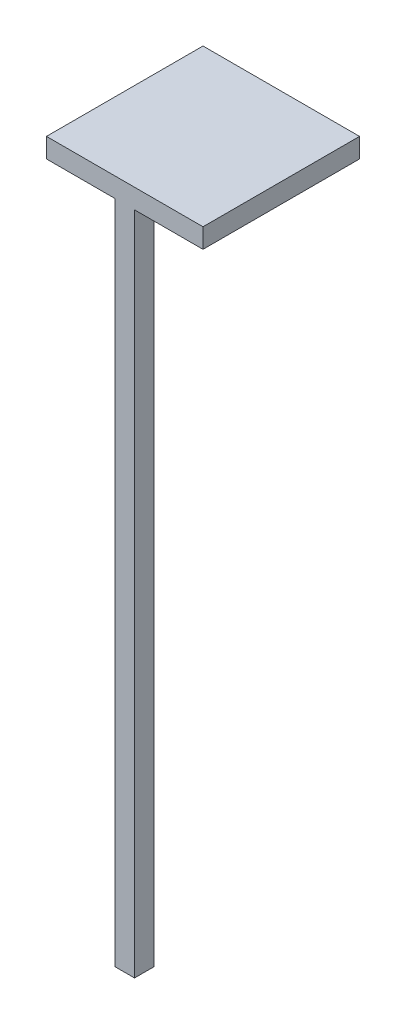
ISO-10303-21;
HEADER;
FILE_DESCRIPTION(('STEP AP214'),'2;1');
FILE_NAME('part.step','',(''),(''),'','','');
FILE_SCHEMA(('AUTOMOTIVE_DESIGN { 1 0 10303 214 1 1 1 1 }'));
ENDSEC;
DATA;
#1=APPLICATION_CONTEXT('core data for automotive mechanical design processes');
#2=APPLICATION_PROTOCOL_DEFINITION('international standard','automotive_design',2000,#1);
#3=PRODUCT_CONTEXT('',#1,'mechanical');
#4=PRODUCT('Part','Part','',(#3));
#5=PRODUCT_RELATED_PRODUCT_CATEGORY('part','',(#4));
#6=PRODUCT_DEFINITION_FORMATION('','',#4);
#7=PRODUCT_DEFINITION_CONTEXT('part definition',#1,'design');
#8=PRODUCT_DEFINITION('design','',#6,#7);
#9=PRODUCT_DEFINITION_SHAPE('','',#8);
#10=(LENGTH_UNIT() NAMED_UNIT(*) SI_UNIT(.MILLI.,.METRE.));
#11=(NAMED_UNIT(*) PLANE_ANGLE_UNIT() SI_UNIT($,.RADIAN.));
#12=(NAMED_UNIT(*) SI_UNIT($,.STERADIAN.) SOLID_ANGLE_UNIT());
#13=UNCERTAINTY_MEASURE_WITH_UNIT(LENGTH_MEASURE(1.E-05),#10,'distance_accuracy_value','');
#14=(GEOMETRIC_REPRESENTATION_CONTEXT(3) GLOBAL_UNCERTAINTY_ASSIGNED_CONTEXT((#13)) GLOBAL_UNIT_ASSIGNED_CONTEXT((#10,
#11,#12)) REPRESENTATION_CONTEXT('',''));
#15=CARTESIAN_POINT('',(0.,0.,0.));
#16=DIRECTION('',(0.,0.,1.));
#17=DIRECTION('',(1.,0.,0.));
#18=AXIS2_PLACEMENT_3D('',#15,#16,#17);
#19=CARTESIAN_POINT('',(0.,340.,0.));
#20=DIRECTION('',(1.,0.,0.));
#21=DIRECTION('',(0.,0.,-1.));
#22=AXIS2_PLACEMENT_3D('',#19,#20,#21);
#23=PLANE('',#22);
#24=DIRECTION('',(0.,0.,1.));
#25=VECTOR('',#24,1.);
#26=CARTESIAN_POINT('',(0.,0.,0.));
#27=LINE('',#26,#25);
#28=CARTESIAN_POINT('',(0.,0.,-10.));
#29=VERTEX_POINT('',#28);
#30=CARTESIAN_POINT('',(0.,0.,0.));
#31=VERTEX_POINT('',#30);
#32=EDGE_CURVE('E130',#29,#31,#27,.T.);
#33=ORIENTED_EDGE('',*,*,#32,.T.);
#34=DIRECTION('',(0.,-1.,0.));
#35=VECTOR('',#34,1.);
#36=CARTESIAN_POINT('',(0.,340.,0.));
#37=LINE('',#36,#35);
#38=CARTESIAN_POINT('',(0.,340.,0.));
#39=VERTEX_POINT('',#38);
#40=EDGE_CURVE('E11',#39,#31,#37,.T.);
#41=ORIENTED_EDGE('',*,*,#40,.F.);
#42=DIRECTION('',(0.,0.,1.));
#43=VECTOR('',#42,1.);
#44=CARTESIAN_POINT('',(0.,340.,0.));
#45=LINE('',#44,#43);
#46=CARTESIAN_POINT('',(0.,340.,-10.));
#47=VERTEX_POINT('',#46);
#48=EDGE_CURVE('E188',#47,#39,#45,.T.);
#49=ORIENTED_EDGE('',*,*,#48,.F.);
#50=DIRECTION('',(0.,-1.,0.));
#51=VECTOR('',#50,1.);
#52=CARTESIAN_POINT('',(0.,340.,-10.));
#53=LINE('',#52,#51);
#54=EDGE_CURVE('E181',#47,#29,#53,.T.);
#55=ORIENTED_EDGE('',*,*,#54,.T.);
#56=EDGE_LOOP('',(#33,#41,#49,#55));
#57=FACE_BOUND('',#56,.T.);
#58=ADVANCED_FACE('F31',(#57),#23,.F.);
#59=CARTESIAN_POINT('',(0.,340.,0.));
#60=DIRECTION('',(0.,0.,-1.));
#61=DIRECTION('',(-1.,0.,0.));
#62=AXIS2_PLACEMENT_3D('',#59,#60,#61);
#63=PLANE('',#62);
#64=DIRECTION('',(1.,0.,0.));
#65=VECTOR('',#64,1.);
#66=CARTESIAN_POINT('',(0.,0.,0.));
#67=LINE('',#66,#65);
#68=CARTESIAN_POINT('',(10.,0.,0.));
#69=VERTEX_POINT('',#68);
#70=EDGE_CURVE('E132',#31,#69,#67,.T.);
#71=ORIENTED_EDGE('',*,*,#70,.T.);
#72=DIRECTION('',(0.,-1.,0.));
#73=VECTOR('',#72,1.);
#74=CARTESIAN_POINT('',(10.,340.,0.));
#75=LINE('',#74,#73);
#76=CARTESIAN_POINT('',(10.,340.,0.));
#77=VERTEX_POINT('',#76);
#78=EDGE_CURVE('E40',#77,#69,#75,.T.);
#79=ORIENTED_EDGE('',*,*,#78,.F.);
#80=DIRECTION('',(1.,0.,0.));
#81=VECTOR('',#80,1.);
#82=CARTESIAN_POINT('',(-35.,340.,0.));
#83=LINE('',#82,#81);
#84=CARTESIAN_POINT('',(45.,340.,0.));
#85=VERTEX_POINT('',#84);
#86=EDGE_CURVE('E142',#77,#85,#83,.T.);
#87=ORIENTED_EDGE('',*,*,#86,.T.);
#88=DIRECTION('',(0.,-1.,0.));
#89=VECTOR('',#88,1.);
#90=CARTESIAN_POINT('',(45.,350.,0.));
#91=LINE('',#90,#89);
#92=CARTESIAN_POINT('',(45.,350.,0.));
#93=VERTEX_POINT('',#92);
#94=EDGE_CURVE('E112',#93,#85,#91,.T.);
#95=ORIENTED_EDGE('',*,*,#94,.F.);
#96=DIRECTION('',(1.,0.,0.));
#97=VECTOR('',#96,1.);
#98=CARTESIAN_POINT('',(-35.,350.,0.));
#99=LINE('',#98,#97);
#100=CARTESIAN_POINT('',(-35.,350.,0.));
#101=VERTEX_POINT('',#100);
#102=EDGE_CURVE('E104',#101,#93,#99,.T.);
#103=ORIENTED_EDGE('',*,*,#102,.F.);
#104=DIRECTION('',(0.,-1.,0.));
#105=VECTOR('',#104,1.);
#106=CARTESIAN_POINT('',(-35.,350.,0.));
#107=LINE('',#106,#105);
#108=CARTESIAN_POINT('',(-35.,340.,0.));
#109=VERTEX_POINT('',#108);
#110=EDGE_CURVE('E109',#101,#109,#107,.T.);
#111=ORIENTED_EDGE('',*,*,#110,.T.);
#112=EDGE_CURVE('E138',#109,#39,#83,.T.);
#113=ORIENTED_EDGE('',*,*,#112,.T.);
#114=ORIENTED_EDGE('',*,*,#40,.T.);
#115=EDGE_LOOP('',(#71,#79,#87,#95,#103,#111,#113,#114));
#116=FACE_BOUND('',#115,.T.);
#117=ADVANCED_FACE('F106',(#116),#63,.F.);
#118=CARTESIAN_POINT('',(10.,340.,0.));
#119=DIRECTION('',(-1.,0.,0.));
#120=DIRECTION('',(0.,0.,1.));
#121=AXIS2_PLACEMENT_3D('',#118,#119,#120);
#122=PLANE('',#121);
#123=DIRECTION('',(0.,0.,-1.));
#124=VECTOR('',#123,1.);
#125=CARTESIAN_POINT('',(10.,0.,0.));
#126=LINE('',#125,#124);
#127=CARTESIAN_POINT('',(10.,0.,-10.));
#128=VERTEX_POINT('',#127);
#129=EDGE_CURVE('E64',#69,#128,#126,.T.);
#130=ORIENTED_EDGE('',*,*,#129,.T.);
#131=DIRECTION('',(0.,-1.,0.));
#132=VECTOR('',#131,1.);
#133=CARTESIAN_POINT('',(10.,340.,-10.));
#134=LINE('',#133,#132);
#135=CARTESIAN_POINT('',(10.,340.,-10.));
#136=VERTEX_POINT('',#135);
#137=EDGE_CURVE('E48',#136,#128,#134,.T.);
#138=ORIENTED_EDGE('',*,*,#137,.F.);
#139=DIRECTION('',(0.,0.,-1.));
#140=VECTOR('',#139,1.);
#141=CARTESIAN_POINT('',(10.,340.,0.));
#142=LINE('',#141,#140);
#143=EDGE_CURVE('E195',#77,#136,#142,.T.);
#144=ORIENTED_EDGE('',*,*,#143,.F.);
#145=ORIENTED_EDGE('',*,*,#78,.T.);
#146=EDGE_LOOP('',(#130,#138,#144,#145));
#147=FACE_BOUND('',#146,.T.);
#148=ADVANCED_FACE('F179',(#147),#122,.F.);
#149=CARTESIAN_POINT('',(0.,340.,-10.));
#150=DIRECTION('',(0.,0.,1.));
#151=DIRECTION('',(1.,0.,0.));
#152=AXIS2_PLACEMENT_3D('',#149,#150,#151);
#153=PLANE('',#152);
#154=DIRECTION('',(-1.,0.,0.));
#155=VECTOR('',#154,1.);
#156=CARTESIAN_POINT('',(0.,0.,-10.));
#157=LINE('',#156,#155);
#158=EDGE_CURVE('E69',#128,#29,#157,.T.);
#159=ORIENTED_EDGE('',*,*,#158,.T.);
#160=ORIENTED_EDGE('',*,*,#54,.F.);
#161=DIRECTION('',(-1.,0.,0.));
#162=VECTOR('',#161,1.);
#163=CARTESIAN_POINT('',(0.,340.,-10.));
#164=LINE('',#163,#162);
#165=EDGE_CURVE('E190',#136,#47,#164,.T.);
#166=ORIENTED_EDGE('',*,*,#165,.F.);
#167=ORIENTED_EDGE('',*,*,#137,.T.);
#168=EDGE_LOOP('',(#159,#160,#166,#167));
#169=FACE_BOUND('',#168,.T.);
#170=ADVANCED_FACE('F200',(#169),#153,.F.);
#171=CARTESIAN_POINT('',(0.,0.,-10.));
#172=DIRECTION('',(0.,-1.,0.));
#173=DIRECTION('',(0.,0.,-1.));
#174=AXIS2_PLACEMENT_3D('',#171,#172,#173);
#175=PLANE('',#174);
#176=ORIENTED_EDGE('',*,*,#32,.F.);
#177=ORIENTED_EDGE('',*,*,#158,.F.);
#178=ORIENTED_EDGE('',*,*,#129,.F.);
#179=ORIENTED_EDGE('',*,*,#70,.F.);
#180=EDGE_LOOP('',(#176,#177,#178,#179));
#181=FACE_BOUND('',#180,.T.);
#182=ADVANCED_FACE('F173',(#181),#175,.T.);
#183=CARTESIAN_POINT('',(-35.,350.,0.));
#184=DIRECTION('',(1.,0.,0.));
#185=DIRECTION('',(0.,0.,-1.));
#186=AXIS2_PLACEMENT_3D('',#183,#184,#185);
#187=PLANE('',#186);
#188=DIRECTION('',(0.,0.,1.));
#189=VECTOR('',#188,1.);
#190=CARTESIAN_POINT('',(-35.,340.,0.));
#191=LINE('',#190,#189);
#192=CARTESIAN_POINT('',(-35.,340.,-80.));
#193=VERTEX_POINT('',#192);
#194=EDGE_CURVE('E129',#193,#109,#191,.T.);
#195=ORIENTED_EDGE('',*,*,#194,.T.);
#196=ORIENTED_EDGE('',*,*,#110,.F.);
#197=DIRECTION('',(0.,0.,1.));
#198=VECTOR('',#197,1.);
#199=CARTESIAN_POINT('',(-35.,350.,0.));
#200=LINE('',#199,#198);
#201=CARTESIAN_POINT('',(-35.,350.,-80.));
#202=VERTEX_POINT('',#201);
#203=EDGE_CURVE('E116',#202,#101,#200,.T.);
#204=ORIENTED_EDGE('',*,*,#203,.F.);
#205=DIRECTION('',(0.,-1.,0.));
#206=VECTOR('',#205,1.);
#207=CARTESIAN_POINT('',(-35.,350.,-80.));
#208=LINE('',#207,#206);
#209=EDGE_CURVE('E151',#202,#193,#208,.T.);
#210=ORIENTED_EDGE('',*,*,#209,.T.);
#211=EDGE_LOOP('',(#195,#196,#204,#210));
#212=FACE_BOUND('',#211,.T.);
#213=ADVANCED_FACE('F127',(#212),#187,.F.);
#214=CARTESIAN_POINT('',(45.,350.,0.));
#215=DIRECTION('',(-1.,0.,0.));
#216=DIRECTION('',(0.,0.,1.));
#217=AXIS2_PLACEMENT_3D('',#214,#215,#216);
#218=PLANE('',#217);
#219=DIRECTION('',(0.,0.,-1.));
#220=VECTOR('',#219,1.);
#221=CARTESIAN_POINT('',(45.,340.,0.));
#222=LINE('',#221,#220);
#223=CARTESIAN_POINT('',(45.,340.,-80.));
#224=VERTEX_POINT('',#223);
#225=EDGE_CURVE('E141',#85,#224,#222,.T.);
#226=ORIENTED_EDGE('',*,*,#225,.T.);
#227=DIRECTION('',(0.,-1.,0.));
#228=VECTOR('',#227,1.);
#229=CARTESIAN_POINT('',(45.,350.,-80.));
#230=LINE('',#229,#228);
#231=CARTESIAN_POINT('',(45.,350.,-80.));
#232=VERTEX_POINT('',#231);
#233=EDGE_CURVE('E134',#232,#224,#230,.T.);
#234=ORIENTED_EDGE('',*,*,#233,.F.);
#235=DIRECTION('',(0.,0.,-1.));
#236=VECTOR('',#235,1.);
#237=CARTESIAN_POINT('',(45.,350.,0.));
#238=LINE('',#237,#236);
#239=EDGE_CURVE('E115',#93,#232,#238,.T.);
#240=ORIENTED_EDGE('',*,*,#239,.F.);
#241=ORIENTED_EDGE('',*,*,#94,.T.);
#242=EDGE_LOOP('',(#226,#234,#240,#241));
#243=FACE_BOUND('',#242,.T.);
#244=ADVANCED_FACE('F164',(#243),#218,.F.);
#245=CARTESIAN_POINT('',(-35.,350.,-80.));
#246=DIRECTION('',(0.,0.,1.));
#247=DIRECTION('',(1.,0.,0.));
#248=AXIS2_PLACEMENT_3D('',#245,#246,#247);
#249=PLANE('',#248);
#250=DIRECTION('',(-1.,0.,0.));
#251=VECTOR('',#250,1.);
#252=CARTESIAN_POINT('',(-35.,340.,-80.));
#253=LINE('',#252,#251);
#254=EDGE_CURVE('E125',#224,#193,#253,.T.);
#255=ORIENTED_EDGE('',*,*,#254,.T.);
#256=ORIENTED_EDGE('',*,*,#209,.F.);
#257=DIRECTION('',(-1.,0.,0.));
#258=VECTOR('',#257,1.);
#259=CARTESIAN_POINT('',(-35.,350.,-80.));
#260=LINE('',#259,#258);
#261=EDGE_CURVE('E121',#232,#202,#260,.T.);
#262=ORIENTED_EDGE('',*,*,#261,.F.);
#263=ORIENTED_EDGE('',*,*,#233,.T.);
#264=EDGE_LOOP('',(#255,#256,#262,#263));
#265=FACE_BOUND('',#264,.T.);
#266=ADVANCED_FACE('F156',(#265),#249,.F.);
#267=CARTESIAN_POINT('',(-35.,350.,-80.));
#268=DIRECTION('',(0.,-1.,0.));
#269=DIRECTION('',(0.,0.,-1.));
#270=AXIS2_PLACEMENT_3D('',#267,#268,#269);
#271=PLANE('',#270);
#272=ORIENTED_EDGE('',*,*,#203,.T.);
#273=ORIENTED_EDGE('',*,*,#102,.T.);
#274=ORIENTED_EDGE('',*,*,#239,.T.);
#275=ORIENTED_EDGE('',*,*,#261,.T.);
#276=EDGE_LOOP('',(#272,#273,#274,#275));
#277=FACE_BOUND('',#276,.T.);
#278=ADVANCED_FACE('F119',(#277),#271,.F.);
#279=CARTESIAN_POINT('',(-35.,340.,-80.));
#280=DIRECTION('',(0.,-1.,0.));
#281=DIRECTION('',(0.,0.,-1.));
#282=AXIS2_PLACEMENT_3D('',#279,#280,#281);
#283=PLANE('',#282);
#284=ORIENTED_EDGE('',*,*,#165,.T.);
#285=ORIENTED_EDGE('',*,*,#48,.T.);
#286=ORIENTED_EDGE('',*,*,#112,.F.);
#287=ORIENTED_EDGE('',*,*,#194,.F.);
#288=ORIENTED_EDGE('',*,*,#254,.F.);
#289=ORIENTED_EDGE('',*,*,#225,.F.);
#290=ORIENTED_EDGE('',*,*,#86,.F.);
#291=ORIENTED_EDGE('',*,*,#143,.T.);
#292=EDGE_LOOP('',(#284,#285,#286,#287,#288,#289,#290,#291));
#293=FACE_BOUND('',#292,.T.);
#294=ADVANCED_FACE('F161',(#293),#283,.T.);
#295=CLOSED_SHELL('',(#58,#117,#148,#170,#182,#213,#244,#266,#278,#294));
#296=MANIFOLD_SOLID_BREP('B2',#295);
#297=ADVANCED_BREP_SHAPE_REPRESENTATION('',(#18,#296),#14);
#298=SHAPE_DEFINITION_REPRESENTATION(#9,#297);
ENDSEC;
END-ISO-10303-21;
